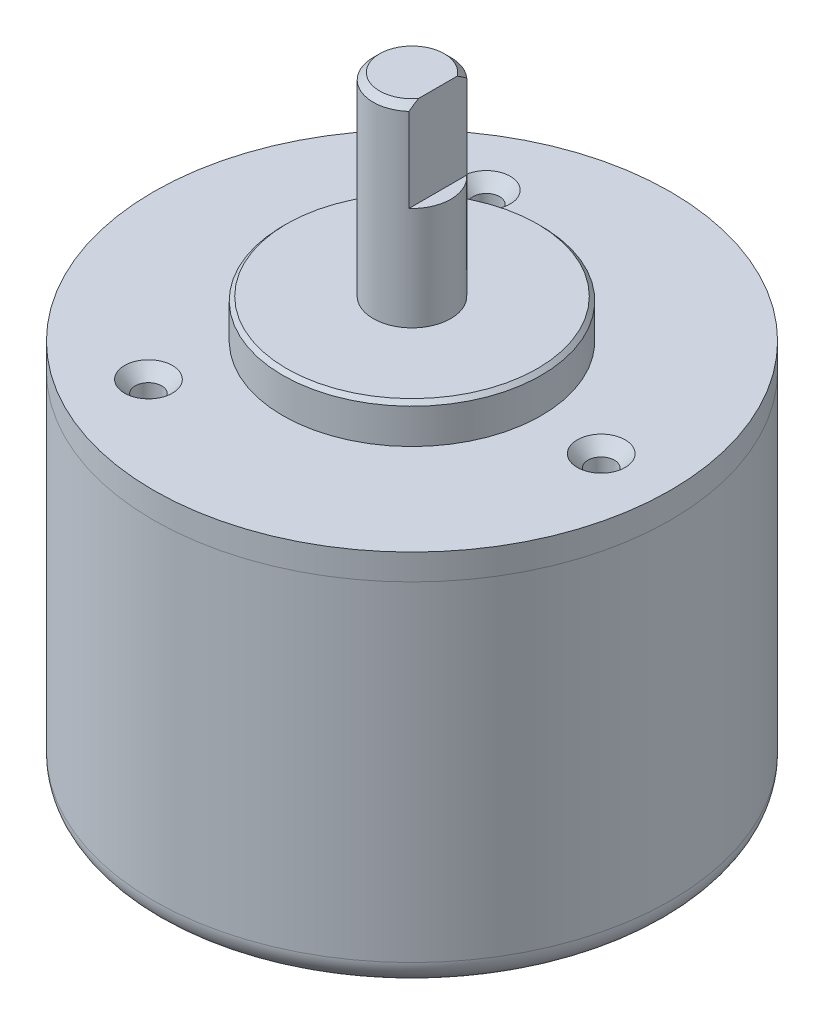
ISO-10303-21;
HEADER;
FILE_DESCRIPTION(('STEP AP214'),'2;1');
FILE_NAME('part.step','',(''),(''),'','','');
FILE_SCHEMA(('AUTOMOTIVE_DESIGN { 1 0 10303 214 1 1 1 1 }'));
ENDSEC;
DATA;
#1=APPLICATION_CONTEXT('core data for automotive mechanical design processes');
#2=APPLICATION_PROTOCOL_DEFINITION('international standard','automotive_design',2000,#1);
#3=PRODUCT_CONTEXT('',#1,'mechanical');
#4=PRODUCT('Part','Part','',(#3));
#5=PRODUCT_RELATED_PRODUCT_CATEGORY('part','',(#4));
#6=PRODUCT_DEFINITION_FORMATION('','',#4);
#7=PRODUCT_DEFINITION_CONTEXT('part definition',#1,'design');
#8=PRODUCT_DEFINITION('design','',#6,#7);
#9=PRODUCT_DEFINITION_SHAPE('','',#8);
#10=(LENGTH_UNIT() NAMED_UNIT(*) SI_UNIT(.MILLI.,.METRE.));
#11=(NAMED_UNIT(*) PLANE_ANGLE_UNIT() SI_UNIT($,.RADIAN.));
#12=(NAMED_UNIT(*) SI_UNIT($,.STERADIAN.) SOLID_ANGLE_UNIT());
#13=UNCERTAINTY_MEASURE_WITH_UNIT(LENGTH_MEASURE(1.E-05),#10,'distance_accuracy_value','');
#14=(GEOMETRIC_REPRESENTATION_CONTEXT(3) GLOBAL_UNCERTAINTY_ASSIGNED_CONTEXT((#13)) GLOBAL_UNIT_ASSIGNED_CONTEXT((#10,
#11,#12)) REPRESENTATION_CONTEXT('',''));
#15=CARTESIAN_POINT('',(0.,0.,0.));
#16=DIRECTION('',(0.,0.,1.));
#17=DIRECTION('',(1.,0.,0.));
#18=AXIS2_PLACEMENT_3D('',#15,#16,#17);
#19=CARTESIAN_POINT('',(0.,-27.5,0.));
#20=DIRECTION('',(0.,1.,0.));
#21=DIRECTION('',(0.,0.,1.));
#22=AXIS2_PLACEMENT_3D('',#19,#20,#21);
#23=CYLINDRICAL_SURFACE('',#22,20.);
#24=CARTESIAN_POINT('',(0.,-25.5,0.));
#25=DIRECTION('',(0.,-1.,0.));
#26=DIRECTION('',(0.,0.,-1.));
#27=AXIS2_PLACEMENT_3D('',#24,#25,#26);
#28=CIRCLE('',#27,20.);
#29=CARTESIAN_POINT('',(0.,-25.5,-20.));
#30=VERTEX_POINT('',#29);
#31=EDGE_CURVE('E12',#30,#30,#28,.F.);
#32=ORIENTED_EDGE('',*,*,#31,.T.);
#33=EDGE_LOOP('',(#32));
#34=FACE_BOUND('',#33,.T.);
#35=CARTESIAN_POINT('',(0.,0.,0.));
#36=DIRECTION('',(0.,-1.,0.));
#37=DIRECTION('',(0.,0.,-1.));
#38=AXIS2_PLACEMENT_3D('',#35,#36,#37);
#39=CIRCLE('',#38,20.);
#40=CARTESIAN_POINT('',(0.,0.,-20.));
#41=VERTEX_POINT('',#40);
#42=EDGE_CURVE('E86',#41,#41,#39,.T.);
#43=ORIENTED_EDGE('',*,*,#42,.T.);
#44=EDGE_LOOP('',(#43));
#45=FACE_BOUND('',#44,.T.);
#46=ADVANCED_FACE('F44',(#34,#45),#23,.T.);
#47=CARTESIAN_POINT('',(0.,-27.5,0.));
#48=DIRECTION('',(0.,-1.,0.));
#49=DIRECTION('',(0.,0.,-1.));
#50=AXIS2_PLACEMENT_3D('',#47,#48,#49);
#51=PLANE('',#50);
#52=CARTESIAN_POINT('',(0.,-27.5,0.));
#53=DIRECTION('',(0.,-1.,0.));
#54=DIRECTION('',(0.,0.,-1.));
#55=AXIS2_PLACEMENT_3D('',#52,#53,#54);
#56=CIRCLE('',#55,18.);
#57=CARTESIAN_POINT('',(0.,-27.5,-18.));
#58=VERTEX_POINT('',#57);
#59=EDGE_CURVE('E53',#58,#58,#56,.T.);
#60=ORIENTED_EDGE('',*,*,#59,.T.);
#61=EDGE_LOOP('',(#60));
#62=FACE_BOUND('',#61,.T.);
#63=ADVANCED_FACE('F92',(#62),#51,.T.);
#64=CARTESIAN_POINT('',(0.,0.,0.));
#65=DIRECTION('',(0.,-1.,0.));
#66=DIRECTION('',(0.,0.,-1.));
#67=AXIS2_PLACEMENT_3D('',#64,#65,#66);
#68=PLANE('',#67);
#69=CARTESIAN_POINT('',(-7.23645615005828,0.,-12.9859039881051));
#70=DIRECTION('',(0.,-1.,0.));
#71=DIRECTION('',(-0.866025403784443,0.,0.499999999999992));
#72=AXIS2_PLACEMENT_3D('',#69,#70,#71);
#73=CIRCLE('',#72,1.02869999999999);
#74=CARTESIAN_POINT('',(-8.12733648293133,0.,-12.4715539881051));
#75=VERTEX_POINT('',#74);
#76=EDGE_CURVE('E73',#75,#75,#73,.T.);
#77=ORIENTED_EDGE('',*,*,#76,.T.);
#78=EDGE_LOOP('',(#77));
#79=FACE_BOUND('',#78,.T.);
#80=CARTESIAN_POINT('',(-7.62789466977547,0.,12.7599068533752));
#81=DIRECTION('',(0.,-1.,0.));
#82=DIRECTION('',(0.866025403784436,0.,0.500000000000004));
#83=AXIS2_PLACEMENT_3D('',#80,#81,#82);
#84=CIRCLE('',#83,1.02869999999999);
#85=CARTESIAN_POINT('',(-6.73701433690243,0.,13.2742568533752));
#86=VERTEX_POINT('',#85);
#87=EDGE_CURVE('E72',#86,#86,#84,.T.);
#88=ORIENTED_EDGE('',*,*,#87,.T.);
#89=EDGE_LOOP('',(#88));
#90=FACE_BOUND('',#89,.T.);
#91=CARTESIAN_POINT('',(14.8643508198338,0.,0.225997134729805));
#92=DIRECTION('',(0.,-1.,0.));
#93=DIRECTION('',(0.,0.,-1.));
#94=AXIS2_PLACEMENT_3D('',#91,#92,#93);
#95=CIRCLE('',#94,1.02869999999999);
#96=CARTESIAN_POINT('',(14.8643508198338,0.,-0.802702865270186));
#97=VERTEX_POINT('',#96);
#98=EDGE_CURVE('E48',#97,#97,#95,.T.);
#99=ORIENTED_EDGE('',*,*,#98,.T.);
#100=EDGE_LOOP('',(#99));
#101=FACE_BOUND('',#100,.T.);
#102=ORIENTED_EDGE('',*,*,#42,.F.);
#103=EDGE_LOOP('',(#102));
#104=FACE_BOUND('',#103,.T.);
#105=ADVANCED_FACE('F96',(#79,#90,#101,#104),#68,.F.);
#106=CARTESIAN_POINT('',(0.,-25.5,0.));
#107=DIRECTION('',(0.,-1.,0.));
#108=DIRECTION('',(0.,0.,-1.));
#109=AXIS2_PLACEMENT_3D('',#106,#107,#108);
#110=TOROIDAL_SURFACE('',#109,18.,2.);
#111=ORIENTED_EDGE('',*,*,#31,.F.);
#112=EDGE_LOOP('',(#111));
#113=FACE_BOUND('',#112,.T.);
#114=ORIENTED_EDGE('',*,*,#59,.F.);
#115=EDGE_LOOP('',(#114));
#116=FACE_BOUND('',#115,.T.);
#117=ADVANCED_FACE('F46',(#113,#116),#110,.T.);
#118=CARTESIAN_POINT('',(14.8643508198338,2.,0.225997134729805));
#119=DIRECTION('',(0.,1.,0.));
#120=DIRECTION('',(0.,0.,1.));
#121=AXIS2_PLACEMENT_3D('',#118,#119,#120);
#122=CYLINDRICAL_SURFACE('',#121,1.02869999999999);
#123=CARTESIAN_POINT('',(14.8643508198338,-7.99999999999999,0.225997134729805));
#124=DIRECTION('',(0.,1.,0.));
#125=DIRECTION('',(0.,0.,1.));
#126=AXIS2_PLACEMENT_3D('',#123,#124,#125);
#127=CIRCLE('',#126,1.02869999999998);
#128=CARTESIAN_POINT('',(14.8643508198338,-7.99999999999999,1.25469713472979));
#129=VERTEX_POINT('',#128);
#130=EDGE_CURVE('E83',#129,#129,#127,.T.);
#131=ORIENTED_EDGE('',*,*,#130,.F.);
#132=EDGE_LOOP('',(#131));
#133=FACE_BOUND('',#132,.T.);
#134=ORIENTED_EDGE('',*,*,#98,.F.);
#135=EDGE_LOOP('',(#134));
#136=FACE_BOUND('',#135,.T.);
#137=ADVANCED_FACE('F95',(#133,#136),#122,.F.);
#138=CARTESIAN_POINT('',(14.8643508198338,-7.99999999999999,0.225997134729805));
#139=DIRECTION('',(0.,1.,0.));
#140=DIRECTION('',(0.,0.,1.));
#141=AXIS2_PLACEMENT_3D('',#138,#139,#140);
#142=CONICAL_SURFACE('',#141,1.02869999999998,1.02974425867664);
#143=CARTESIAN_POINT('',(14.8643508198338,-8.61810531879365,0.225997134729805));
#144=VERTEX_POINT('',#143);
#145=VERTEX_LOOP('',#144);
#146=FACE_BOUND('',#145,.T.);
#147=ORIENTED_EDGE('',*,*,#130,.T.);
#148=EDGE_LOOP('',(#147));
#149=FACE_BOUND('',#148,.T.);
#150=ADVANCED_FACE('F102',(#146,#149),#142,.F.);
#151=CARTESIAN_POINT('',(-7.62789466977547,2.,12.7599068533752));
#152=DIRECTION('',(0.,1.,0.));
#153=DIRECTION('',(-0.866025403784436,0.,-0.500000000000004));
#154=AXIS2_PLACEMENT_3D('',#151,#152,#153);
#155=CYLINDRICAL_SURFACE('',#154,1.02869999999999);
#156=CARTESIAN_POINT('',(-7.62789466977547,-7.99999999999999,12.7599068533752));
#157=DIRECTION('',(0.,1.,0.));
#158=DIRECTION('',(-0.866025403784436,0.,-0.500000000000004));
#159=AXIS2_PLACEMENT_3D('',#156,#157,#158);
#160=CIRCLE('',#159,1.02869999999998);
#161=CARTESIAN_POINT('',(-8.51877500264851,-7.99999999999999,12.2455568533752));
#162=VERTEX_POINT('',#161);
#163=EDGE_CURVE('E76',#162,#162,#160,.T.);
#164=ORIENTED_EDGE('',*,*,#163,.F.);
#165=EDGE_LOOP('',(#164));
#166=FACE_BOUND('',#165,.T.);
#167=ORIENTED_EDGE('',*,*,#87,.F.);
#168=EDGE_LOOP('',(#167));
#169=FACE_BOUND('',#168,.T.);
#170=ADVANCED_FACE('F117',(#166,#169),#155,.F.);
#171=CARTESIAN_POINT('',(-7.62789466977547,-7.99999999999999,12.7599068533752));
#172=DIRECTION('',(0.,1.,0.));
#173=DIRECTION('',(-0.866025403784436,0.,-0.500000000000004));
#174=AXIS2_PLACEMENT_3D('',#171,#172,#173);
#175=CONICAL_SURFACE('',#174,1.02869999999998,1.02974425867664);
#176=CARTESIAN_POINT('',(-7.62789466977547,-8.61810531879365,12.7599068533752));
#177=VERTEX_POINT('',#176);
#178=VERTEX_LOOP('',#177);
#179=FACE_BOUND('',#178,.T.);
#180=ORIENTED_EDGE('',*,*,#163,.T.);
#181=EDGE_LOOP('',(#180));
#182=FACE_BOUND('',#181,.T.);
#183=ADVANCED_FACE('F121',(#179,#182),#175,.F.);
#184=CARTESIAN_POINT('',(-7.23645615005828,2.,-12.9859039881051));
#185=DIRECTION('',(0.,1.,0.));
#186=DIRECTION('',(0.866025403784443,0.,-0.499999999999992));
#187=AXIS2_PLACEMENT_3D('',#184,#185,#186);
#188=CYLINDRICAL_SURFACE('',#187,1.02869999999999);
#189=CARTESIAN_POINT('',(-7.23645615005828,-7.99999999999999,-12.9859039881051));
#190=DIRECTION('',(0.,1.,0.));
#191=DIRECTION('',(0.866025403784443,0.,-0.499999999999992));
#192=AXIS2_PLACEMENT_3D('',#189,#190,#191);
#193=CIRCLE('',#192,1.02869999999998);
#194=CARTESIAN_POINT('',(-6.34557581718523,-7.99999999999999,-13.5002539881051));
#195=VERTEX_POINT('',#194);
#196=EDGE_CURVE('E70',#195,#195,#193,.T.);
#197=ORIENTED_EDGE('',*,*,#196,.F.);
#198=EDGE_LOOP('',(#197));
#199=FACE_BOUND('',#198,.T.);
#200=ORIENTED_EDGE('',*,*,#76,.F.);
#201=EDGE_LOOP('',(#200));
#202=FACE_BOUND('',#201,.T.);
#203=ADVANCED_FACE('F66',(#199,#202),#188,.F.);
#204=CARTESIAN_POINT('',(-7.23645615005828,-7.99999999999999,-12.9859039881051));
#205=DIRECTION('',(0.,1.,0.));
#206=DIRECTION('',(0.866025403784443,0.,-0.499999999999992));
#207=AXIS2_PLACEMENT_3D('',#204,#205,#206);
#208=CONICAL_SURFACE('',#207,1.02869999999998,1.02974425867664);
#209=CARTESIAN_POINT('',(-7.23645615005828,-8.61810531879365,-12.9859039881051));
#210=VERTEX_POINT('',#209);
#211=VERTEX_LOOP('',#210);
#212=FACE_BOUND('',#211,.T.);
#213=ORIENTED_EDGE('',*,*,#196,.T.);
#214=EDGE_LOOP('',(#213));
#215=FACE_BOUND('',#214,.T.);
#216=ADVANCED_FACE('F63',(#212,#215),#208,.F.);
#217=CLOSED_SHELL('',(#46,#63,#105,#117,#137,#150,#170,#183,#203,#216));
#218=MANIFOLD_SOLID_BREP('B2',#217);
#219=CARTESIAN_POINT('',(0.,5.,0.));
#220=DIRECTION('',(0.,1.,0.));
#221=DIRECTION('',(0.,0.,1.));
#222=AXIS2_PLACEMENT_3D('',#219,#220,#221);
#223=PLANE('',#222);
#224=CARTESIAN_POINT('',(0.,5.,0.));
#225=DIRECTION('',(0.,1.,0.));
#226=DIRECTION('',(0.,0.,1.));
#227=AXIS2_PLACEMENT_3D('',#224,#225,#226);
#228=CIRCLE('',#227,9.70000000000001);
#229=CARTESIAN_POINT('',(0.,5.,9.70000000000001));
#230=VERTEX_POINT('',#229);
#231=EDGE_CURVE('E248',#230,#230,#228,.T.);
#232=ORIENTED_EDGE('',*,*,#231,.T.);
#233=EDGE_LOOP('',(#232));
#234=FACE_BOUND('',#233,.T.);
#235=CARTESIAN_POINT('',(0.,5.,0.));
#236=DIRECTION('',(0.,1.,0.));
#237=DIRECTION('',(0.,0.,1.));
#238=AXIS2_PLACEMENT_3D('',#235,#236,#237);
#239=CIRCLE('',#238,3.);
#240=CARTESIAN_POINT('',(0.,5.,3.));
#241=VERTEX_POINT('',#240);
#242=EDGE_CURVE('E304',#241,#241,#239,.T.);
#243=ORIENTED_EDGE('',*,*,#242,.F.);
#244=EDGE_LOOP('',(#243));
#245=FACE_BOUND('',#244,.T.);
#246=ADVANCED_FACE('F199',(#234,#245),#223,.T.);
#247=CARTESIAN_POINT('',(0.,2.,0.));
#248=DIRECTION('',(0.,1.,0.));
#249=DIRECTION('',(0.,0.,1.));
#250=AXIS2_PLACEMENT_3D('',#247,#248,#249);
#251=PLANE('',#250);
#252=CARTESIAN_POINT('',(-7.23645615005828,2.,-12.9859039881051));
#253=DIRECTION('',(0.,1.,0.));
#254=DIRECTION('',(0.866025403784443,0.,-0.499999999999992));
#255=AXIS2_PLACEMENT_3D('',#252,#253,#254);
#256=CIRCLE('',#255,1.8542);
#257=CARTESIAN_POINT('',(-5.63067184636116,2.,-13.9130039881051));
#258=VERTEX_POINT('',#257);
#259=EDGE_CURVE('E338',#258,#258,#256,.T.);
#260=ORIENTED_EDGE('',*,*,#259,.F.);
#261=EDGE_LOOP('',(#260));
#262=FACE_BOUND('',#261,.T.);
#263=CARTESIAN_POINT('',(-7.62789466977547,2.,12.7599068533752));
#264=DIRECTION('',(0.,1.,0.));
#265=DIRECTION('',(-0.866025403784436,0.,-0.500000000000004));
#266=AXIS2_PLACEMENT_3D('',#263,#264,#265);
#267=CIRCLE('',#266,1.8542);
#268=CARTESIAN_POINT('',(-9.23367897347257,2.,11.8328068533752));
#269=VERTEX_POINT('',#268);
#270=EDGE_CURVE('E329',#269,#269,#267,.T.);
#271=ORIENTED_EDGE('',*,*,#270,.F.);
#272=EDGE_LOOP('',(#271));
#273=FACE_BOUND('',#272,.T.);
#274=CARTESIAN_POINT('',(14.8643508198338,2.,0.225997134729805));
#275=DIRECTION('',(0.,1.,0.));
#276=DIRECTION('',(0.,0.,1.));
#277=AXIS2_PLACEMENT_3D('',#274,#275,#276);
#278=CIRCLE('',#277,1.8542);
#279=CARTESIAN_POINT('',(14.8643508198338,2.,2.0801971347298));
#280=VERTEX_POINT('',#279);
#281=EDGE_CURVE('E320',#280,#280,#278,.T.);
#282=ORIENTED_EDGE('',*,*,#281,.F.);
#283=EDGE_LOOP('',(#282));
#284=FACE_BOUND('',#283,.T.);
#285=CARTESIAN_POINT('',(0.,2.,0.));
#286=DIRECTION('',(0.,1.,0.));
#287=DIRECTION('',(0.,0.,1.));
#288=AXIS2_PLACEMENT_3D('',#285,#286,#287);
#289=CIRCLE('',#288,20.);
#290=CARTESIAN_POINT('',(0.,2.,20.));
#291=VERTEX_POINT('',#290);
#292=EDGE_CURVE('E246',#291,#291,#289,.T.);
#293=ORIENTED_EDGE('',*,*,#292,.T.);
#294=EDGE_LOOP('',(#293));
#295=FACE_BOUND('',#294,.T.);
#296=CARTESIAN_POINT('',(0.,2.,0.));
#297=DIRECTION('',(0.,1.,0.));
#298=DIRECTION('',(0.,0.,1.));
#299=AXIS2_PLACEMENT_3D('',#296,#297,#298);
#300=CIRCLE('',#299,10.);
#301=CARTESIAN_POINT('',(0.,2.,10.));
#302=VERTEX_POINT('',#301);
#303=EDGE_CURVE('E302',#302,#302,#300,.T.);
#304=ORIENTED_EDGE('',*,*,#303,.F.);
#305=EDGE_LOOP('',(#304));
#306=FACE_BOUND('',#305,.T.);
#307=ADVANCED_FACE('F281',(#262,#273,#284,#295,#306),#251,.T.);
#308=CARTESIAN_POINT('',(0.,2.,0.));
#309=DIRECTION('',(0.,-1.,0.));
#310=DIRECTION('',(0.,0.,-1.));
#311=AXIS2_PLACEMENT_3D('',#308,#309,#310);
#312=CYLINDRICAL_SURFACE('',#311,20.);
#313=ORIENTED_EDGE('',*,*,#292,.F.);
#314=EDGE_LOOP('',(#313));
#315=FACE_BOUND('',#314,.T.);
#316=CARTESIAN_POINT('',(0.,0.,0.));
#317=DIRECTION('',(0.,1.,0.));
#318=DIRECTION('',(0.,0.,1.));
#319=AXIS2_PLACEMENT_3D('',#316,#317,#318);
#320=CIRCLE('',#319,20.);
#321=CARTESIAN_POINT('',(0.,0.,20.));
#322=VERTEX_POINT('',#321);
#323=EDGE_CURVE('E251',#322,#322,#320,.T.);
#324=ORIENTED_EDGE('',*,*,#323,.T.);
#325=EDGE_LOOP('',(#324));
#326=FACE_BOUND('',#325,.T.);
#327=ADVANCED_FACE('F289',(#315,#326),#312,.T.);
#328=CARTESIAN_POINT('',(0.,0.,0.));
#329=DIRECTION('',(0.,1.,0.));
#330=DIRECTION('',(0.,0.,1.));
#331=AXIS2_PLACEMENT_3D('',#328,#329,#330);
#332=PLANE('',#331);
#333=CARTESIAN_POINT('',(-7.23645615005828,0.,-12.9859039881051));
#334=DIRECTION('',(0.,1.,0.));
#335=DIRECTION('',(0.866025403784443,0.,-0.499999999999992));
#336=AXIS2_PLACEMENT_3D('',#333,#334,#335);
#337=CIRCLE('',#336,1.02869999999999);
#338=CARTESIAN_POINT('',(-6.34557581718523,0.,-13.5002539881051));
#339=VERTEX_POINT('',#338);
#340=EDGE_CURVE('E335',#339,#339,#337,.T.);
#341=ORIENTED_EDGE('',*,*,#340,.T.);
#342=EDGE_LOOP('',(#341));
#343=FACE_BOUND('',#342,.T.);
#344=CARTESIAN_POINT('',(-7.62789466977547,0.,12.7599068533752));
#345=DIRECTION('',(0.,1.,0.));
#346=DIRECTION('',(-0.866025403784436,0.,-0.500000000000004));
#347=AXIS2_PLACEMENT_3D('',#344,#345,#346);
#348=CIRCLE('',#347,1.02869999999999);
#349=CARTESIAN_POINT('',(-8.51877500264851,0.,12.2455568533752));
#350=VERTEX_POINT('',#349);
#351=EDGE_CURVE('E326',#350,#350,#348,.T.);
#352=ORIENTED_EDGE('',*,*,#351,.T.);
#353=EDGE_LOOP('',(#352));
#354=FACE_BOUND('',#353,.T.);
#355=CARTESIAN_POINT('',(14.8643508198338,0.,0.225997134729805));
#356=DIRECTION('',(0.,1.,0.));
#357=DIRECTION('',(0.,0.,1.));
#358=AXIS2_PLACEMENT_3D('',#355,#356,#357);
#359=CIRCLE('',#358,1.02869999999999);
#360=CARTESIAN_POINT('',(14.8643508198338,0.,1.2546971347298));
#361=VERTEX_POINT('',#360);
#362=EDGE_CURVE('E203',#361,#361,#359,.T.);
#363=ORIENTED_EDGE('',*,*,#362,.T.);
#364=EDGE_LOOP('',(#363));
#365=FACE_BOUND('',#364,.T.);
#366=ORIENTED_EDGE('',*,*,#323,.F.);
#367=EDGE_LOOP('',(#366));
#368=FACE_BOUND('',#367,.T.);
#369=ADVANCED_FACE('F285',(#343,#354,#365,#368),#332,.F.);
#370=CARTESIAN_POINT('',(0.,5.,0.));
#371=DIRECTION('',(0.,-1.,0.));
#372=DIRECTION('',(0.,0.,-1.));
#373=AXIS2_PLACEMENT_3D('',#370,#371,#372);
#374=CYLINDRICAL_SURFACE('',#373,10.);
#375=CARTESIAN_POINT('',(0.,4.69999999999999,0.));
#376=DIRECTION('',(0.,1.,0.));
#377=DIRECTION('',(0.,0.,1.));
#378=AXIS2_PLACEMENT_3D('',#375,#376,#377);
#379=CIRCLE('',#378,10.);
#380=CARTESIAN_POINT('',(0.,4.69999999999999,10.));
#381=VERTEX_POINT('',#380);
#382=EDGE_CURVE('E257',#381,#381,#379,.F.);
#383=ORIENTED_EDGE('',*,*,#382,.T.);
#384=EDGE_LOOP('',(#383));
#385=FACE_BOUND('',#384,.T.);
#386=ORIENTED_EDGE('',*,*,#303,.T.);
#387=EDGE_LOOP('',(#386));
#388=FACE_BOUND('',#387,.T.);
#389=ADVANCED_FACE('F277',(#385,#388),#374,.T.);
#390=CARTESIAN_POINT('',(0.,20.,0.));
#391=DIRECTION('',(0.,-1.,0.));
#392=DIRECTION('',(0.,0.,-1.));
#393=AXIS2_PLACEMENT_3D('',#390,#391,#392);
#394=CYLINDRICAL_SURFACE('',#393,3.);
#395=CARTESIAN_POINT('',(0.,19.5,0.));
#396=DIRECTION('',(0.,1.,0.));
#397=DIRECTION('',(0.,0.,1.));
#398=AXIS2_PLACEMENT_3D('',#395,#396,#397);
#399=CIRCLE('',#398,3.);
#400=CARTESIAN_POINT('',(2.,19.5,2.23606797749979));
#401=VERTEX_POINT('',#400);
#402=CARTESIAN_POINT('',(2.,19.5,-2.23606797749979));
#403=VERTEX_POINT('',#402);
#404=EDGE_CURVE('E245',#401,#403,#399,.F.);
#405=ORIENTED_EDGE('',*,*,#404,.T.);
#406=DIRECTION('',(0.,-1.,0.));
#407=VECTOR('',#406,1.);
#408=CARTESIAN_POINT('',(2.,20.,-2.23606797749979));
#409=LINE('',#408,#407);
#410=CARTESIAN_POINT('',(2.,13.,-2.23606797749979));
#411=VERTEX_POINT('',#410);
#412=EDGE_CURVE('E221',#403,#411,#409,.T.);
#413=ORIENTED_EDGE('',*,*,#412,.T.);
#414=CARTESIAN_POINT('',(0.,13.,0.));
#415=DIRECTION('',(0.,1.,0.));
#416=DIRECTION('',(0.,0.,1.));
#417=AXIS2_PLACEMENT_3D('',#414,#415,#416);
#418=CIRCLE('',#417,3.);
#419=CARTESIAN_POINT('',(2.,13.,2.23606797749979));
#420=VERTEX_POINT('',#419);
#421=EDGE_CURVE('E42',#420,#411,#418,.T.);
#422=ORIENTED_EDGE('',*,*,#421,.F.);
#423=DIRECTION('',(0.,-1.,0.));
#424=VECTOR('',#423,1.);
#425=CARTESIAN_POINT('',(2.,20.,2.23606797749979));
#426=LINE('',#425,#424);
#427=EDGE_CURVE('E312',#420,#401,#426,.F.);
#428=ORIENTED_EDGE('',*,*,#427,.T.);
#429=EDGE_LOOP('',(#405,#413,#422,#428));
#430=FACE_BOUND('',#429,.T.);
#431=ORIENTED_EDGE('',*,*,#242,.T.);
#432=EDGE_LOOP('',(#431));
#433=FACE_BOUND('',#432,.T.);
#434=ADVANCED_FACE('F274',(#430,#433),#394,.T.);
#435=CARTESIAN_POINT('',(0.,20.,0.));
#436=DIRECTION('',(0.,1.,0.));
#437=DIRECTION('',(0.,0.,1.));
#438=AXIS2_PLACEMENT_3D('',#435,#436,#437);
#439=PLANE('',#438);
#440=DIRECTION('',(0.,0.,1.));
#441=VECTOR('',#440,1.);
#442=CARTESIAN_POINT('',(2.,20.,0.));
#443=LINE('',#442,#441);
#444=CARTESIAN_POINT('',(2.,20.,-1.49999999999999));
#445=VERTEX_POINT('',#444);
#446=CARTESIAN_POINT('',(2.,20.,1.49999999999999));
#447=VERTEX_POINT('',#446);
#448=EDGE_CURVE('E215',#445,#447,#443,.T.);
#449=ORIENTED_EDGE('',*,*,#448,.F.);
#450=CARTESIAN_POINT('',(0.,20.,0.));
#451=DIRECTION('',(0.,1.,0.));
#452=DIRECTION('',(0.,0.,1.));
#453=AXIS2_PLACEMENT_3D('',#450,#451,#452);
#454=CIRCLE('',#453,2.5);
#455=EDGE_CURVE('E241',#445,#447,#454,.T.);
#456=ORIENTED_EDGE('',*,*,#455,.T.);
#457=EDGE_LOOP('',(#449,#456));
#458=FACE_BOUND('',#457,.T.);
#459=ADVANCED_FACE('F240',(#458),#439,.T.);
#460=CARTESIAN_POINT('',(0.,20.,0.));
#461=DIRECTION('',(0.,-1.,0.));
#462=DIRECTION('',(0.,0.,-1.));
#463=AXIS2_PLACEMENT_3D('',#460,#461,#462);
#464=CONICAL_SURFACE('',#463,2.5,0.78539816339745);
#465=CARTESIAN_POINT('',(2.,15.8873216263623,-6.30297669939971));
#466=CARTESIAN_POINT('',(2.,15.9934654188676,-6.19161538231921));
#467=CARTESIAN_POINT('',(2.,16.0994766865765,-6.08012784166974));
#468=CARTESIAN_POINT('',(2.,16.3111832346176,-5.85685182740819));
#469=CARTESIAN_POINT('',(2.,16.416878512911,-5.74506335186335));
#470=CARTESIAN_POINT('',(2.,16.7334799534095,-5.4091037400752));
#471=CARTESIAN_POINT('',(2.,16.9438332007284,-5.18441017570404));
#472=CARTESIAN_POINT('',(2.,17.3645130906793,-4.73080338017173));
#473=CARTESIAN_POINT('',(2.,17.5748184834026,-4.50187041839723));
#474=CARTESIAN_POINT('',(2.,17.9921398339185,-4.04109600653749));
#475=CARTESIAN_POINT('',(2.,18.1991564869832,-3.80925519025911));
#476=CARTESIAN_POINT('',(2.,18.5427094339617,-3.41557477398932));
#477=CARTESIAN_POINT('',(2.,18.6806734892414,-3.25498354268553));
#478=CARTESIAN_POINT('',(2.,18.9530414106355,-2.93065759329856));
#479=CARTESIAN_POINT('',(2.,19.0874436429248,-2.7669214900715));
#480=CARTESIAN_POINT('',(2.,19.2846540132489,-2.5181266956277));
#481=CARTESIAN_POINT('',(2.,19.349589732802,-2.43475662118928));
#482=CARTESIAN_POINT('',(2.,19.4776417312762,-2.26663374732055));
#483=CARTESIAN_POINT('',(2.,19.5407581286648,-2.18188103848768));
#484=CARTESIAN_POINT('',(2.,19.6645933363178,-2.01072574565116));
#485=CARTESIAN_POINT('',(2.,19.7253138031099,-1.92432436509384));
#486=CARTESIAN_POINT('',(2.,19.8436296466813,-1.74941695008946));
#487=CARTESIAN_POINT('',(2.,19.9012257001644,-1.6609113774015));
#488=CARTESIAN_POINT('',(2.,19.9992212710428,-1.50227028732204));
#489=CARTESIAN_POINT('',(2.,20.0404935943275,-1.43267637104486));
#490=CARTESIAN_POINT('',(2.,20.1198677964186,-1.29167710661276));
#491=CARTESIAN_POINT('',(2.,20.1579691862347,-1.22027148128109));
#492=CARTESIAN_POINT('',(2.,20.2300460130542,-1.07546452699157));
#493=CARTESIAN_POINT('',(2.,20.2640254658395,-1.00206522711486));
#494=CARTESIAN_POINT('',(2.,20.3267151787812,-0.853081142949163));
#495=CARTESIAN_POINT('',(2.,20.3554271816017,-0.777497091069906));
#496=CARTESIAN_POINT('',(2.,20.4192396638115,-0.584403393214644));
#497=CARTESIAN_POINT('',(2.,20.4500128348776,-0.465352306558809));
#498=CARTESIAN_POINT('',(2.,20.4807588195801,-0.284397555948325));
#499=CARTESIAN_POINT('',(2.,20.488438502314,-0.223763847529551));
#500=CARTESIAN_POINT('',(2.,20.4983151195682,-0.102037460980293));
#501=CARTESIAN_POINT('',(2.,20.5005123357594,-0.0409448065906727));
#502=CARTESIAN_POINT('',(2.,20.4992836906337,0.0813412240179482));
#503=CARTESIAN_POINT('',(2.,20.4958430479094,0.142534443442988));
#504=CARTESIAN_POINT('',(2.,20.4835143071468,0.264365149349651));
#505=CARTESIAN_POINT('',(2.,20.4746258153165,0.325002595336176));
#506=CARTESIAN_POINT('',(2.,20.4518382366568,0.445513581328032));
#507=CARTESIAN_POINT('',(2.,20.437923432345,0.505384108194577));
#508=CARTESIAN_POINT('',(2.,20.4057165246167,0.623920460080753));
#509=CARTESIAN_POINT('',(2.,20.3874241670008,0.6825862149258));
#510=CARTESIAN_POINT('',(2.,20.3223195036355,0.87009667914147));
#511=CARTESIAN_POINT('',(2.,20.2681300929727,0.996380524334717));
#512=CARTESIAN_POINT('',(2.,20.1476478589649,1.24305957355026));
#513=CARTESIAN_POINT('',(2.,20.0813307945582,1.36344236007696));
#514=CARTESIAN_POINT('',(2.,19.9398352181217,1.60114682986082));
#515=CARTESIAN_POINT('',(2.,19.8645442578527,1.71840078274327));
#516=CARTESIAN_POINT('',(2.,19.7475913945842,1.89143789202114));
#517=CARTESIAN_POINT('',(2.,19.707955998579,1.94861845845231));
#518=CARTESIAN_POINT('',(2.,19.6275512752209,2.06217670530471));
#519=CARTESIAN_POINT('',(2.,19.5867819751893,2.11855440502148));
#520=CARTESIAN_POINT('',(2.,19.474196769287,2.27151937990445));
#521=CARTESIAN_POINT('',(2.,19.4014431443246,2.36741546158161));
#522=CARTESIAN_POINT('',(2.,19.2538303699529,2.55757734840228));
#523=CARTESIAN_POINT('',(2.,19.1789710414011,2.65184301372992));
#524=CARTESIAN_POINT('',(2.,19.0276197624691,2.83909574994454));
#525=CARTESIAN_POINT('',(2.,18.9511273546395,2.93208245025613));
#526=CARTESIAN_POINT('',(2.,18.7968779319394,3.11700238327254));
#527=CARTESIAN_POINT('',(2.,18.7191208849615,3.20893558912925));
#528=CARTESIAN_POINT('',(2.,18.4840952575393,3.48375900151842));
#529=CARTESIAN_POINT('',(2.,18.3253249307297,3.66536407471734));
#530=CARTESIAN_POINT('',(2.,18.0051814767041,4.02619748135239));
#531=CARTESIAN_POINT('',(2.,17.8438087898096,4.20542620770821));
#532=CARTESIAN_POINT('',(2.,17.533936581731,4.54602117157569));
#533=CARTESIAN_POINT('',(2.,17.3855969838316,4.70753312366637));
#534=CARTESIAN_POINT('',(2.,17.0877703518185,5.02950930464933));
#535=CARTESIAN_POINT('',(2.,16.9382832600569,5.18997348014397));
#536=CARTESIAN_POINT('',(2.,16.6389288168518,5.50956314093424));
#537=CARTESIAN_POINT('',(2.,16.4890643030356,5.66869128700744));
#538=CARTESIAN_POINT('',(2.,16.1886586900713,5.98628664721592));
#539=CARTESIAN_POINT('',(2.,16.0381176393484,6.14475390713849));
#540=CARTESIAN_POINT('',(2.,15.8873216263623,6.30297669939971));
#541=B_SPLINE_CURVE_WITH_KNOTS('',3,(#465,#466,#467,#468,#469,#470,#471,#472,#473,#474,#475,
#476,#477,#478,#479,#480,#481,#482,#483,#484,#485,#486,#487,#488,#489,#490,#491,#492,#493,#494,
#495,#496,#497,#498,#499,#500,#501,#502,#503,#504,#505,#506,#507,#508,#509,#510,#511,#512,#513,
#514,#515,#516,#517,#518,#519,#520,#521,#522,#523,#524,#525,#526,#527,#528,#529,#530,#531,#532,
#533,#534,#535,#536,#537,#538,#539,#540),.UNSPECIFIED.,.F.,.F.,(4,2,2,2,2,2,2,2,2,2,2,2,2,2,2,2,
2,2,2,2,2,2,2,2,2,2,2,2,2,2,2,2,2,2,2,2,2,4),(0.,0.461530395848075,0.923063762999835,
1.8464281457078,2.77901494137712,3.71140188239744,4.34652018448137,4.98192494520127,
5.29893184459039,5.61591805480018,5.93268111936178,6.24937530133096,6.49204579715624,
6.73475364617267,6.97722310585571,7.21961220258092,7.58685502448719,7.76999772547682,
7.95313101701503,8.13674521833653,8.32037269357644,8.50457942200897,8.68879684970661,
9.09991327785319,9.51186062066998,9.92965689883885,10.1383717107001,10.3470814979544,
10.7081519451168,11.0692532037656,11.4304569749129,11.7916699308902,12.5152929670805,
13.2387948242448,13.8966755650346,14.5545895756197,15.2103542781078,15.8660727671492),.UNSPECIFIED.);
#542=EDGE_CURVE('E208',#403,#445,#541,.T.);
#543=ORIENTED_EDGE('',*,*,#542,.F.);
#544=ORIENTED_EDGE('',*,*,#404,.F.);
#545=EDGE_CURVE('E236',#447,#401,#541,.T.);
#546=ORIENTED_EDGE('',*,*,#545,.F.);
#547=ORIENTED_EDGE('',*,*,#455,.F.);
#548=EDGE_LOOP('',(#543,#544,#546,#547));
#549=FACE_BOUND('',#548,.T.);
#550=ADVANCED_FACE('F244',(#549),#464,.T.);
#551=CARTESIAN_POINT('',(0.,5.,0.));
#552=DIRECTION('',(0.,-1.,0.));
#553=DIRECTION('',(0.,0.,-1.));
#554=AXIS2_PLACEMENT_3D('',#551,#552,#553);
#555=CONICAL_SURFACE('',#554,9.70000000000001,0.785398163397428);
#556=ORIENTED_EDGE('',*,*,#382,.F.);
#557=EDGE_LOOP('',(#556));
#558=FACE_BOUND('',#557,.T.);
#559=ORIENTED_EDGE('',*,*,#231,.F.);
#560=EDGE_LOOP('',(#559));
#561=FACE_BOUND('',#560,.T.);
#562=ADVANCED_FACE('F201',(#558,#561),#555,.T.);
#563=CARTESIAN_POINT('',(0.,13.,0.));
#564=DIRECTION('',(0.,1.,0.));
#565=DIRECTION('',(0.,0.,1.));
#566=AXIS2_PLACEMENT_3D('',#563,#564,#565);
#567=PLANE('',#566);
#568=ORIENTED_EDGE('',*,*,#421,.T.);
#569=DIRECTION('',(0.,0.,1.));
#570=VECTOR('',#569,1.);
#571=CARTESIAN_POINT('',(2.,13.,-3.));
#572=LINE('',#571,#570);
#573=EDGE_CURVE('E242',#411,#420,#572,.T.);
#574=ORIENTED_EDGE('',*,*,#573,.T.);
#575=EDGE_LOOP('',(#568,#574));
#576=FACE_BOUND('',#575,.T.);
#577=ADVANCED_FACE('F270',(#576),#567,.T.);
#578=CARTESIAN_POINT('',(2.,13.,0.));
#579=DIRECTION('',(-1.,0.,0.));
#580=DIRECTION('',(0.,0.,1.));
#581=AXIS2_PLACEMENT_3D('',#578,#579,#580);
#582=PLANE('',#581);
#583=ORIENTED_EDGE('',*,*,#542,.T.);
#584=ORIENTED_EDGE('',*,*,#448,.T.);
#585=ORIENTED_EDGE('',*,*,#545,.T.);
#586=ORIENTED_EDGE('',*,*,#427,.F.);
#587=ORIENTED_EDGE('',*,*,#573,.F.);
#588=ORIENTED_EDGE('',*,*,#412,.F.);
#589=EDGE_LOOP('',(#583,#584,#585,#586,#587,#588));
#590=FACE_BOUND('',#589,.T.);
#591=ADVANCED_FACE('F231',(#590),#582,.F.);
#592=CARTESIAN_POINT('',(14.8643508198338,2.,0.225997134729805));
#593=DIRECTION('',(0.,1.,0.));
#594=DIRECTION('',(0.,0.,1.));
#595=AXIS2_PLACEMENT_3D('',#592,#593,#594);
#596=CYLINDRICAL_SURFACE('',#595,1.02869999999999);
#597=CARTESIAN_POINT('',(14.8643508198338,1.05037087983906,0.225997134729805));
#598=DIRECTION('',(0.,1.,0.));
#599=DIRECTION('',(0.,0.,1.));
#600=AXIS2_PLACEMENT_3D('',#597,#598,#599);
#601=CIRCLE('',#600,1.0287);
#602=CARTESIAN_POINT('',(14.8643508198338,1.05037087983906,1.2546971347298));
#603=VERTEX_POINT('',#602);
#604=EDGE_CURVE('E317',#603,#603,#601,.T.);
#605=ORIENTED_EDGE('',*,*,#604,.T.);
#606=EDGE_LOOP('',(#605));
#607=FACE_BOUND('',#606,.T.);
#608=ORIENTED_EDGE('',*,*,#362,.F.);
#609=EDGE_LOOP('',(#608));
#610=FACE_BOUND('',#609,.T.);
#611=ADVANCED_FACE('F269',(#607,#610),#596,.F.);
#612=CARTESIAN_POINT('',(14.8643508198338,2.,0.225997134729805));
#613=DIRECTION('',(0.,1.,0.));
#614=DIRECTION('',(0.,0.,1.));
#615=AXIS2_PLACEMENT_3D('',#612,#613,#614);
#616=CONICAL_SURFACE('',#615,1.8542,0.715584993317674);
#617=ORIENTED_EDGE('',*,*,#604,.F.);
#618=EDGE_LOOP('',(#617));
#619=FACE_BOUND('',#618,.T.);
#620=ORIENTED_EDGE('',*,*,#281,.T.);
#621=EDGE_LOOP('',(#620));
#622=FACE_BOUND('',#621,.T.);
#623=ADVANCED_FACE('F350',(#619,#622),#616,.F.);
#624=CARTESIAN_POINT('',(-7.62789466977547,2.,12.7599068533752));
#625=DIRECTION('',(0.,1.,0.));
#626=DIRECTION('',(-0.866025403784436,0.,-0.500000000000004));
#627=AXIS2_PLACEMENT_3D('',#624,#625,#626);
#628=CYLINDRICAL_SURFACE('',#627,1.02869999999999);
#629=CARTESIAN_POINT('',(-7.62789466977547,1.05037087983906,12.7599068533752));
#630=DIRECTION('',(0.,1.,0.));
#631=DIRECTION('',(-0.866025403784436,0.,-0.500000000000004));
#632=AXIS2_PLACEMENT_3D('',#629,#630,#631);
#633=CIRCLE('',#632,1.0287);
#634=CARTESIAN_POINT('',(-8.51877500264852,1.05037087983906,12.2455568533752));
#635=VERTEX_POINT('',#634);
#636=EDGE_CURVE('E323',#635,#635,#633,.T.);
#637=ORIENTED_EDGE('',*,*,#636,.T.);
#638=EDGE_LOOP('',(#637));
#639=FACE_BOUND('',#638,.T.);
#640=ORIENTED_EDGE('',*,*,#351,.F.);
#641=EDGE_LOOP('',(#640));
#642=FACE_BOUND('',#641,.T.);
#643=ADVANCED_FACE('F352',(#639,#642),#628,.F.);
#644=CARTESIAN_POINT('',(-7.62789466977547,2.,12.7599068533752));
#645=DIRECTION('',(0.,1.,0.));
#646=DIRECTION('',(-0.866025403784436,0.,-0.500000000000004));
#647=AXIS2_PLACEMENT_3D('',#644,#645,#646);
#648=CONICAL_SURFACE('',#647,1.8542,0.715584993317674);
#649=ORIENTED_EDGE('',*,*,#636,.F.);
#650=EDGE_LOOP('',(#649));
#651=FACE_BOUND('',#650,.T.);
#652=ORIENTED_EDGE('',*,*,#270,.T.);
#653=EDGE_LOOP('',(#652));
#654=FACE_BOUND('',#653,.T.);
#655=ADVANCED_FACE('F359',(#651,#654),#648,.F.);
#656=CARTESIAN_POINT('',(-7.23645615005828,2.,-12.9859039881051));
#657=DIRECTION('',(0.,1.,0.));
#658=DIRECTION('',(0.866025403784443,0.,-0.499999999999992));
#659=AXIS2_PLACEMENT_3D('',#656,#657,#658);
#660=CYLINDRICAL_SURFACE('',#659,1.02869999999999);
#661=CARTESIAN_POINT('',(-7.23645615005828,1.05037087983906,-12.9859039881051));
#662=DIRECTION('',(0.,1.,0.));
#663=DIRECTION('',(0.866025403784443,0.,-0.499999999999992));
#664=AXIS2_PLACEMENT_3D('',#661,#662,#663);
#665=CIRCLE('',#664,1.0287);
#666=CARTESIAN_POINT('',(-6.34557581718522,1.05037087983906,-13.5002539881051));
#667=VERTEX_POINT('',#666);
#668=EDGE_CURVE('E332',#667,#667,#665,.T.);
#669=ORIENTED_EDGE('',*,*,#668,.T.);
#670=EDGE_LOOP('',(#669));
#671=FACE_BOUND('',#670,.T.);
#672=ORIENTED_EDGE('',*,*,#340,.F.);
#673=EDGE_LOOP('',(#672));
#674=FACE_BOUND('',#673,.T.);
#675=ADVANCED_FACE('F367',(#671,#674),#660,.F.);
#676=CARTESIAN_POINT('',(-7.23645615005828,2.,-12.9859039881051));
#677=DIRECTION('',(0.,1.,0.));
#678=DIRECTION('',(0.866025403784443,0.,-0.499999999999992));
#679=AXIS2_PLACEMENT_3D('',#676,#677,#678);
#680=CONICAL_SURFACE('',#679,1.8542,0.715584993317674);
#681=ORIENTED_EDGE('',*,*,#668,.F.);
#682=EDGE_LOOP('',(#681));
#683=FACE_BOUND('',#682,.T.);
#684=ORIENTED_EDGE('',*,*,#259,.T.);
#685=EDGE_LOOP('',(#684));
#686=FACE_BOUND('',#685,.T.);
#687=ADVANCED_FACE('F342',(#683,#686),#680,.F.);
#688=CLOSED_SHELL('',(#246,#307,#327,#369,#389,#434,#459,#550,#562,#577,#591,#611,#623,#643,
#655,#675,#687));
#689=MANIFOLD_SOLID_BREP('B6',#688);
#690=ADVANCED_BREP_SHAPE_REPRESENTATION('',(#18,#218,#689),#14);
#691=SHAPE_DEFINITION_REPRESENTATION(#9,#690);
ENDSEC;
END-ISO-10303-21;
